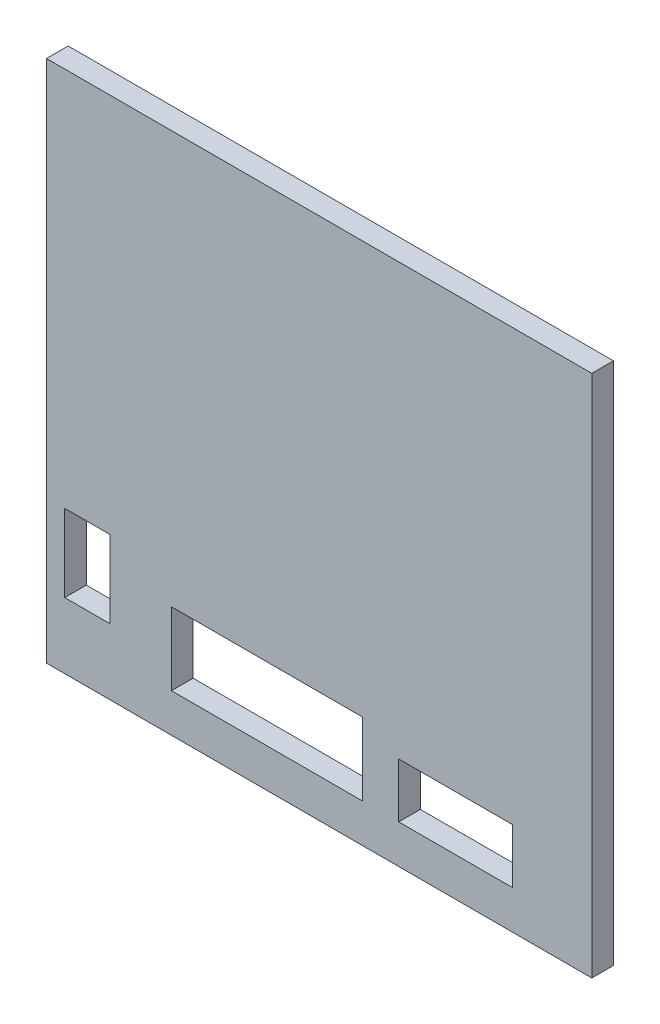
ISO-10303-21;
HEADER;
FILE_DESCRIPTION(('STEP AP214'),'2;1');
FILE_NAME('part.step','',(''),(''),'','','');
FILE_SCHEMA(('AUTOMOTIVE_DESIGN { 1 0 10303 214 1 1 1 1 }'));
ENDSEC;
DATA;
#1=APPLICATION_CONTEXT('core data for automotive mechanical design processes');
#2=APPLICATION_PROTOCOL_DEFINITION('international standard','automotive_design',2000,#1);
#3=PRODUCT_CONTEXT('',#1,'mechanical');
#4=PRODUCT('Part','Part','',(#3));
#5=PRODUCT_RELATED_PRODUCT_CATEGORY('part','',(#4));
#6=PRODUCT_DEFINITION_FORMATION('','',#4);
#7=PRODUCT_DEFINITION_CONTEXT('part definition',#1,'design');
#8=PRODUCT_DEFINITION('design','',#6,#7);
#9=PRODUCT_DEFINITION_SHAPE('','',#8);
#10=(LENGTH_UNIT() NAMED_UNIT(*) SI_UNIT(.MILLI.,.METRE.));
#11=(NAMED_UNIT(*) PLANE_ANGLE_UNIT() SI_UNIT($,.RADIAN.));
#12=(NAMED_UNIT(*) SI_UNIT($,.STERADIAN.) SOLID_ANGLE_UNIT());
#13=UNCERTAINTY_MEASURE_WITH_UNIT(LENGTH_MEASURE(1.E-05),#10,'distance_accuracy_value','');
#14=(GEOMETRIC_REPRESENTATION_CONTEXT(3) GLOBAL_UNCERTAINTY_ASSIGNED_CONTEXT((#13)) GLOBAL_UNIT_ASSIGNED_CONTEXT((#10,
#11,#12)) REPRESENTATION_CONTEXT('',''));
#15=CARTESIAN_POINT('',(0.,0.,0.));
#16=DIRECTION('',(0.,0.,1.));
#17=DIRECTION('',(1.,0.,0.));
#18=AXIS2_PLACEMENT_3D('',#15,#16,#17);
#19=CARTESIAN_POINT('',(60.,-57.61875,-4.7625));
#20=DIRECTION('',(1.,0.,0.));
#21=DIRECTION('',(0.,0.,-1.));
#22=AXIS2_PLACEMENT_3D('',#19,#20,#21);
#23=PLANE('',#22);
#24=DIRECTION('',(0.,1.,0.));
#25=VECTOR('',#24,1.);
#26=CARTESIAN_POINT('',(60.,-57.61875,0.));
#27=LINE('',#26,#25);
#28=CARTESIAN_POINT('',(60.,-57.61875,0.));
#29=VERTEX_POINT('',#28);
#30=CARTESIAN_POINT('',(60.,57.61875,0.));
#31=VERTEX_POINT('',#30);
#32=EDGE_CURVE('E239',#29,#31,#27,.T.);
#33=ORIENTED_EDGE('',*,*,#32,.F.);
#34=DIRECTION('',(0.,0.,1.));
#35=VECTOR('',#34,1.);
#36=CARTESIAN_POINT('',(60.,-57.61875,-4.7625));
#37=LINE('',#36,#35);
#38=CARTESIAN_POINT('',(60.,-57.61875,-4.7625));
#39=VERTEX_POINT('',#38);
#40=EDGE_CURVE('E11',#39,#29,#37,.T.);
#41=ORIENTED_EDGE('',*,*,#40,.F.);
#42=DIRECTION('',(0.,1.,0.));
#43=VECTOR('',#42,1.);
#44=CARTESIAN_POINT('',(60.,-57.61875,-4.7625));
#45=LINE('',#44,#43);
#46=CARTESIAN_POINT('',(60.,57.61875,-4.7625));
#47=VERTEX_POINT('',#46);
#48=EDGE_CURVE('E246',#39,#47,#45,.T.);
#49=ORIENTED_EDGE('',*,*,#48,.T.);
#50=DIRECTION('',(0.,0.,1.));
#51=VECTOR('',#50,1.);
#52=CARTESIAN_POINT('',(60.,57.61875,-4.7625));
#53=LINE('',#52,#51);
#54=EDGE_CURVE('E35',#47,#31,#53,.T.);
#55=ORIENTED_EDGE('',*,*,#54,.T.);
#56=EDGE_LOOP('',(#33,#41,#49,#55));
#57=FACE_BOUND('',#56,.T.);
#58=ADVANCED_FACE('F32',(#57),#23,.T.);
#59=CARTESIAN_POINT('',(-60.,-57.61875,-4.7625));
#60=DIRECTION('',(0.,-1.,0.));
#61=DIRECTION('',(0.,0.,-1.));
#62=AXIS2_PLACEMENT_3D('',#59,#60,#61);
#63=PLANE('',#62);
#64=DIRECTION('',(1.,0.,0.));
#65=VECTOR('',#64,1.);
#66=CARTESIAN_POINT('',(-60.,-57.61875,0.));
#67=LINE('',#66,#65);
#68=CARTESIAN_POINT('',(-60.,-57.61875,0.));
#69=VERTEX_POINT('',#68);
#70=EDGE_CURVE('E250',#69,#29,#67,.T.);
#71=ORIENTED_EDGE('',*,*,#70,.F.);
#72=DIRECTION('',(0.,0.,1.));
#73=VECTOR('',#72,1.);
#74=CARTESIAN_POINT('',(-60.,-57.61875,-4.7625));
#75=LINE('',#74,#73);
#76=CARTESIAN_POINT('',(-60.,-57.61875,-4.7625));
#77=VERTEX_POINT('',#76);
#78=EDGE_CURVE('E40',#77,#69,#75,.T.);
#79=ORIENTED_EDGE('',*,*,#78,.F.);
#80=DIRECTION('',(1.,0.,0.));
#81=VECTOR('',#80,1.);
#82=CARTESIAN_POINT('',(-60.,-57.61875,-4.7625));
#83=LINE('',#82,#81);
#84=EDGE_CURVE('E256',#77,#39,#83,.T.);
#85=ORIENTED_EDGE('',*,*,#84,.T.);
#86=ORIENTED_EDGE('',*,*,#40,.T.);
#87=EDGE_LOOP('',(#71,#79,#85,#86));
#88=FACE_BOUND('',#87,.T.);
#89=ADVANCED_FACE('F282',(#88),#63,.T.);
#90=CARTESIAN_POINT('',(-60.,-57.61875,-4.7625));
#91=DIRECTION('',(-1.,0.,0.));
#92=DIRECTION('',(0.,0.,1.));
#93=AXIS2_PLACEMENT_3D('',#90,#91,#92);
#94=PLANE('',#93);
#95=DIRECTION('',(0.,-1.,0.));
#96=VECTOR('',#95,1.);
#97=CARTESIAN_POINT('',(-60.,-57.61875,0.));
#98=LINE('',#97,#96);
#99=CARTESIAN_POINT('',(-60.,57.61875,0.));
#100=VERTEX_POINT('',#99);
#101=EDGE_CURVE('E264',#100,#69,#98,.T.);
#102=ORIENTED_EDGE('',*,*,#101,.F.);
#103=DIRECTION('',(0.,0.,1.));
#104=VECTOR('',#103,1.);
#105=CARTESIAN_POINT('',(-60.,57.61875,-4.7625));
#106=LINE('',#105,#104);
#107=CARTESIAN_POINT('',(-60.,57.61875,-4.7625));
#108=VERTEX_POINT('',#107);
#109=EDGE_CURVE('E269',#108,#100,#106,.T.);
#110=ORIENTED_EDGE('',*,*,#109,.F.);
#111=DIRECTION('',(0.,-1.,0.));
#112=VECTOR('',#111,1.);
#113=CARTESIAN_POINT('',(-60.,-57.61875,-4.7625));
#114=LINE('',#113,#112);
#115=EDGE_CURVE('E253',#108,#77,#114,.T.);
#116=ORIENTED_EDGE('',*,*,#115,.T.);
#117=ORIENTED_EDGE('',*,*,#78,.T.);
#118=EDGE_LOOP('',(#102,#110,#116,#117));
#119=FACE_BOUND('',#118,.T.);
#120=ADVANCED_FACE('F287',(#119),#94,.T.);
#121=CARTESIAN_POINT('',(-60.,57.61875,-4.7625));
#122=DIRECTION('',(0.,1.,0.));
#123=DIRECTION('',(0.,0.,1.));
#124=AXIS2_PLACEMENT_3D('',#121,#122,#123);
#125=PLANE('',#124);
#126=DIRECTION('',(-1.,0.,0.));
#127=VECTOR('',#126,1.);
#128=CARTESIAN_POINT('',(-60.,57.61875,0.));
#129=LINE('',#128,#127);
#130=EDGE_CURVE('E261',#31,#100,#129,.T.);
#131=ORIENTED_EDGE('',*,*,#130,.F.);
#132=ORIENTED_EDGE('',*,*,#54,.F.);
#133=DIRECTION('',(-1.,0.,0.));
#134=VECTOR('',#133,1.);
#135=CARTESIAN_POINT('',(-60.,57.61875,-4.7625));
#136=LINE('',#135,#134);
#137=EDGE_CURVE('E249',#47,#108,#136,.T.);
#138=ORIENTED_EDGE('',*,*,#137,.T.);
#139=ORIENTED_EDGE('',*,*,#109,.T.);
#140=EDGE_LOOP('',(#131,#132,#138,#139));
#141=FACE_BOUND('',#140,.T.);
#142=ADVANCED_FACE('F277',(#141),#125,.T.);
#143=CARTESIAN_POINT('',(0.,0.,-4.7625));
#144=DIRECTION('',(0.,0.,-1.));
#145=DIRECTION('',(-1.,0.,0.));
#146=AXIS2_PLACEMENT_3D('',#143,#144,#145);
#147=PLANE('',#146);
#148=DIRECTION('',(0.,1.,0.));
#149=VECTOR('',#148,1.);
#150=CARTESIAN_POINT('',(-46.,-26.11875,-4.7625));
#151=LINE('',#150,#149);
#152=CARTESIAN_POINT('',(-46.,-43.11875,-4.7625));
#153=VERTEX_POINT('',#152);
#154=CARTESIAN_POINT('',(-46.,-26.11875,-4.7625));
#155=VERTEX_POINT('',#154);
#156=EDGE_CURVE('E147',#153,#155,#151,.T.);
#157=ORIENTED_EDGE('',*,*,#156,.T.);
#158=DIRECTION('',(-1.,0.,0.));
#159=VECTOR('',#158,1.);
#160=CARTESIAN_POINT('',(-56.,-26.11875,-4.7625));
#161=LINE('',#160,#159);
#162=CARTESIAN_POINT('',(-56.,-26.11875,-4.7625));
#163=VERTEX_POINT('',#162);
#164=EDGE_CURVE('E156',#155,#163,#161,.T.);
#165=ORIENTED_EDGE('',*,*,#164,.T.);
#166=DIRECTION('',(0.,-1.,0.));
#167=VECTOR('',#166,1.);
#168=CARTESIAN_POINT('',(-56.,-26.11875,-4.7625));
#169=LINE('',#168,#167);
#170=CARTESIAN_POINT('',(-56.,-43.11875,-4.7625));
#171=VERTEX_POINT('',#170);
#172=EDGE_CURVE('E48',#163,#171,#169,.T.);
#173=ORIENTED_EDGE('',*,*,#172,.T.);
#174=DIRECTION('',(1.,0.,0.));
#175=VECTOR('',#174,1.);
#176=CARTESIAN_POINT('',(-56.,-43.11875,-4.7625));
#177=LINE('',#176,#175);
#178=EDGE_CURVE('E153',#171,#153,#177,.T.);
#179=ORIENTED_EDGE('',*,*,#178,.T.);
#180=EDGE_LOOP('',(#157,#165,#173,#179));
#181=FACE_BOUND('',#180,.T.);
#182=DIRECTION('',(0.,1.,0.));
#183=VECTOR('',#182,1.);
#184=CARTESIAN_POINT('',(9.5,-33.11875,-4.7625));
#185=LINE('',#184,#183);
#186=CARTESIAN_POINT('',(9.5,-49.11875,-4.7625));
#187=VERTEX_POINT('',#186);
#188=CARTESIAN_POINT('',(9.5,-33.11875,-4.7625));
#189=VERTEX_POINT('',#188);
#190=EDGE_CURVE('E182',#187,#189,#185,.T.);
#191=ORIENTED_EDGE('',*,*,#190,.T.);
#192=DIRECTION('',(-1.,0.,0.));
#193=VECTOR('',#192,1.);
#194=CARTESIAN_POINT('',(-32.5,-33.11875,-4.7625));
#195=LINE('',#194,#193);
#196=CARTESIAN_POINT('',(-32.5,-33.11875,-4.7625));
#197=VERTEX_POINT('',#196);
#198=EDGE_CURVE('E185',#189,#197,#195,.T.);
#199=ORIENTED_EDGE('',*,*,#198,.T.);
#200=DIRECTION('',(0.,-1.,0.));
#201=VECTOR('',#200,1.);
#202=CARTESIAN_POINT('',(-32.5,-33.11875,-4.7625));
#203=LINE('',#202,#201);
#204=CARTESIAN_POINT('',(-32.5,-49.11875,-4.7625));
#205=VERTEX_POINT('',#204);
#206=EDGE_CURVE('E189',#197,#205,#203,.T.);
#207=ORIENTED_EDGE('',*,*,#206,.T.);
#208=DIRECTION('',(1.,0.,0.));
#209=VECTOR('',#208,1.);
#210=CARTESIAN_POINT('',(-32.5,-49.11875,-4.7625));
#211=LINE('',#210,#209);
#212=EDGE_CURVE('E192',#205,#187,#211,.T.);
#213=ORIENTED_EDGE('',*,*,#212,.T.);
#214=EDGE_LOOP('',(#191,#199,#207,#213));
#215=FACE_BOUND('',#214,.T.);
#216=DIRECTION('',(0.,1.,0.));
#217=VECTOR('',#216,1.);
#218=CARTESIAN_POINT('',(42.5,-37.11875,-4.7625));
#219=LINE('',#218,#217);
#220=CARTESIAN_POINT('',(42.5,-49.11875,-4.7625));
#221=VERTEX_POINT('',#220);
#222=CARTESIAN_POINT('',(42.5,-37.11875,-4.7625));
#223=VERTEX_POINT('',#222);
#224=EDGE_CURVE('E214',#221,#223,#219,.T.);
#225=ORIENTED_EDGE('',*,*,#224,.T.);
#226=DIRECTION('',(-1.,0.,0.));
#227=VECTOR('',#226,1.);
#228=CARTESIAN_POINT('',(17.5,-37.11875,-4.7625));
#229=LINE('',#228,#227);
#230=CARTESIAN_POINT('',(17.5,-37.11875,-4.7625));
#231=VERTEX_POINT('',#230);
#232=EDGE_CURVE('E217',#223,#231,#229,.T.);
#233=ORIENTED_EDGE('',*,*,#232,.T.);
#234=DIRECTION('',(0.,-1.,0.));
#235=VECTOR('',#234,1.);
#236=CARTESIAN_POINT('',(17.5,-37.11875,-4.7625));
#237=LINE('',#236,#235);
#238=CARTESIAN_POINT('',(17.5,-49.11875,-4.7625));
#239=VERTEX_POINT('',#238);
#240=EDGE_CURVE('E221',#231,#239,#237,.T.);
#241=ORIENTED_EDGE('',*,*,#240,.T.);
#242=DIRECTION('',(1.,0.,0.));
#243=VECTOR('',#242,1.);
#244=CARTESIAN_POINT('',(17.5,-49.11875,-4.7625));
#245=LINE('',#244,#243);
#246=EDGE_CURVE('E224',#239,#221,#245,.T.);
#247=ORIENTED_EDGE('',*,*,#246,.T.);
#248=EDGE_LOOP('',(#225,#233,#241,#247));
#249=FACE_BOUND('',#248,.T.);
#250=ORIENTED_EDGE('',*,*,#48,.F.);
#251=ORIENTED_EDGE('',*,*,#84,.F.);
#252=ORIENTED_EDGE('',*,*,#115,.F.);
#253=ORIENTED_EDGE('',*,*,#137,.F.);
#254=EDGE_LOOP('',(#250,#251,#252,#253));
#255=FACE_BOUND('',#254,.T.);
#256=ADVANCED_FACE('F160',(#181,#215,#249,#255),#147,.T.);
#257=CARTESIAN_POINT('',(0.,0.,0.));
#258=DIRECTION('',(0.,0.,-1.));
#259=DIRECTION('',(-1.,0.,0.));
#260=AXIS2_PLACEMENT_3D('',#257,#258,#259);
#261=PLANE('',#260);
#262=DIRECTION('',(-1.,0.,0.));
#263=VECTOR('',#262,1.);
#264=CARTESIAN_POINT('',(-56.,-26.11875,0.));
#265=LINE('',#264,#263);
#266=CARTESIAN_POINT('',(-46.,-26.11875,0.));
#267=VERTEX_POINT('',#266);
#268=CARTESIAN_POINT('',(-56.,-26.11875,0.));
#269=VERTEX_POINT('',#268);
#270=EDGE_CURVE('E172',#267,#269,#265,.T.);
#271=ORIENTED_EDGE('',*,*,#270,.F.);
#272=DIRECTION('',(0.,1.,0.));
#273=VECTOR('',#272,1.);
#274=CARTESIAN_POINT('',(-46.,-26.11875,0.));
#275=LINE('',#274,#273);
#276=CARTESIAN_POINT('',(-46.,-43.11875,0.));
#277=VERTEX_POINT('',#276);
#278=EDGE_CURVE('E56',#277,#267,#275,.T.);
#279=ORIENTED_EDGE('',*,*,#278,.F.);
#280=DIRECTION('',(1.,0.,0.));
#281=VECTOR('',#280,1.);
#282=CARTESIAN_POINT('',(-56.,-43.11875,0.));
#283=LINE('',#282,#281);
#284=CARTESIAN_POINT('',(-56.,-43.11875,0.));
#285=VERTEX_POINT('',#284);
#286=EDGE_CURVE('E163',#285,#277,#283,.T.);
#287=ORIENTED_EDGE('',*,*,#286,.F.);
#288=DIRECTION('',(0.,-1.,0.));
#289=VECTOR('',#288,1.);
#290=CARTESIAN_POINT('',(-56.,-26.11875,0.));
#291=LINE('',#290,#289);
#292=EDGE_CURVE('E166',#269,#285,#291,.T.);
#293=ORIENTED_EDGE('',*,*,#292,.F.);
#294=EDGE_LOOP('',(#271,#279,#287,#293));
#295=FACE_BOUND('',#294,.T.);
#296=DIRECTION('',(-1.,0.,0.));
#297=VECTOR('',#296,1.);
#298=CARTESIAN_POINT('',(-32.5,-33.11875,0.));
#299=LINE('',#298,#297);
#300=CARTESIAN_POINT('',(9.5,-33.11875,0.));
#301=VERTEX_POINT('',#300);
#302=CARTESIAN_POINT('',(-32.5,-33.11875,0.));
#303=VERTEX_POINT('',#302);
#304=EDGE_CURVE('E197',#301,#303,#299,.T.);
#305=ORIENTED_EDGE('',*,*,#304,.F.);
#306=DIRECTION('',(0.,1.,0.));
#307=VECTOR('',#306,1.);
#308=CARTESIAN_POINT('',(9.5,-33.11875,0.));
#309=LINE('',#308,#307);
#310=CARTESIAN_POINT('',(9.5,-49.11875,0.));
#311=VERTEX_POINT('',#310);
#312=EDGE_CURVE('E178',#311,#301,#309,.T.);
#313=ORIENTED_EDGE('',*,*,#312,.F.);
#314=DIRECTION('',(1.,0.,0.));
#315=VECTOR('',#314,1.);
#316=CARTESIAN_POINT('',(-32.5,-49.11875,0.));
#317=LINE('',#316,#315);
#318=CARTESIAN_POINT('',(-32.5,-49.11875,0.));
#319=VERTEX_POINT('',#318);
#320=EDGE_CURVE('E186',#319,#311,#317,.T.);
#321=ORIENTED_EDGE('',*,*,#320,.F.);
#322=DIRECTION('',(0.,-1.,0.));
#323=VECTOR('',#322,1.);
#324=CARTESIAN_POINT('',(-32.5,-33.11875,0.));
#325=LINE('',#324,#323);
#326=EDGE_CURVE('E200',#303,#319,#325,.T.);
#327=ORIENTED_EDGE('',*,*,#326,.F.);
#328=EDGE_LOOP('',(#305,#313,#321,#327));
#329=FACE_BOUND('',#328,.T.);
#330=DIRECTION('',(-1.,0.,0.));
#331=VECTOR('',#330,1.);
#332=CARTESIAN_POINT('',(17.5,-37.11875,0.));
#333=LINE('',#332,#331);
#334=CARTESIAN_POINT('',(42.5,-37.11875,0.));
#335=VERTEX_POINT('',#334);
#336=CARTESIAN_POINT('',(17.5,-37.11875,0.));
#337=VERTEX_POINT('',#336);
#338=EDGE_CURVE('E229',#335,#337,#333,.T.);
#339=ORIENTED_EDGE('',*,*,#338,.F.);
#340=DIRECTION('',(0.,1.,0.));
#341=VECTOR('',#340,1.);
#342=CARTESIAN_POINT('',(42.5,-37.11875,0.));
#343=LINE('',#342,#341);
#344=CARTESIAN_POINT('',(42.5,-49.11875,0.));
#345=VERTEX_POINT('',#344);
#346=EDGE_CURVE('E207',#345,#335,#343,.T.);
#347=ORIENTED_EDGE('',*,*,#346,.F.);
#348=DIRECTION('',(1.,0.,0.));
#349=VECTOR('',#348,1.);
#350=CARTESIAN_POINT('',(17.5,-49.11875,0.));
#351=LINE('',#350,#349);
#352=CARTESIAN_POINT('',(17.5,-49.11875,0.));
#353=VERTEX_POINT('',#352);
#354=EDGE_CURVE('E218',#353,#345,#351,.T.);
#355=ORIENTED_EDGE('',*,*,#354,.F.);
#356=DIRECTION('',(0.,-1.,0.));
#357=VECTOR('',#356,1.);
#358=CARTESIAN_POINT('',(17.5,-37.11875,0.));
#359=LINE('',#358,#357);
#360=EDGE_CURVE('E232',#337,#353,#359,.T.);
#361=ORIENTED_EDGE('',*,*,#360,.F.);
#362=EDGE_LOOP('',(#339,#347,#355,#361));
#363=FACE_BOUND('',#362,.T.);
#364=ORIENTED_EDGE('',*,*,#32,.T.);
#365=ORIENTED_EDGE('',*,*,#130,.T.);
#366=ORIENTED_EDGE('',*,*,#101,.T.);
#367=ORIENTED_EDGE('',*,*,#70,.T.);
#368=EDGE_LOOP('',(#364,#365,#366,#367));
#369=FACE_BOUND('',#368,.T.);
#370=ADVANCED_FACE('F279',(#295,#329,#363,#369),#261,.F.);
#371=CARTESIAN_POINT('',(42.5,-37.11875,-4.7625));
#372=DIRECTION('',(1.,0.,0.));
#373=DIRECTION('',(0.,0.,-1.));
#374=AXIS2_PLACEMENT_3D('',#371,#372,#373);
#375=PLANE('',#374);
#376=ORIENTED_EDGE('',*,*,#346,.T.);
#377=DIRECTION('',(0.,0.,1.));
#378=VECTOR('',#377,1.);
#379=CARTESIAN_POINT('',(42.5,-37.11875,-4.7625));
#380=LINE('',#379,#378);
#381=EDGE_CURVE('E227',#223,#335,#380,.T.);
#382=ORIENTED_EDGE('',*,*,#381,.F.);
#383=ORIENTED_EDGE('',*,*,#224,.F.);
#384=DIRECTION('',(0.,0.,1.));
#385=VECTOR('',#384,1.);
#386=CARTESIAN_POINT('',(42.5,-49.11875,-4.7625));
#387=LINE('',#386,#385);
#388=EDGE_CURVE('E237',#221,#345,#387,.T.);
#389=ORIENTED_EDGE('',*,*,#388,.T.);
#390=EDGE_LOOP('',(#376,#382,#383,#389));
#391=FACE_BOUND('',#390,.T.);
#392=ADVANCED_FACE('F329',(#391),#375,.F.);
#393=CARTESIAN_POINT('',(17.5,-49.11875,-4.7625));
#394=DIRECTION('',(0.,-1.,0.));
#395=DIRECTION('',(0.,0.,-1.));
#396=AXIS2_PLACEMENT_3D('',#393,#394,#395);
#397=PLANE('',#396);
#398=ORIENTED_EDGE('',*,*,#354,.T.);
#399=ORIENTED_EDGE('',*,*,#388,.F.);
#400=ORIENTED_EDGE('',*,*,#246,.F.);
#401=DIRECTION('',(0.,0.,1.));
#402=VECTOR('',#401,1.);
#403=CARTESIAN_POINT('',(17.5,-49.11875,-4.7625));
#404=LINE('',#403,#402);
#405=EDGE_CURVE('E240',#239,#353,#404,.T.);
#406=ORIENTED_EDGE('',*,*,#405,.T.);
#407=EDGE_LOOP('',(#398,#399,#400,#406));
#408=FACE_BOUND('',#407,.T.);
#409=ADVANCED_FACE('F339',(#408),#397,.F.);
#410=CARTESIAN_POINT('',(17.5,-37.11875,-4.7625));
#411=DIRECTION('',(-1.,0.,0.));
#412=DIRECTION('',(0.,0.,1.));
#413=AXIS2_PLACEMENT_3D('',#410,#411,#412);
#414=PLANE('',#413);
#415=ORIENTED_EDGE('',*,*,#360,.T.);
#416=ORIENTED_EDGE('',*,*,#405,.F.);
#417=ORIENTED_EDGE('',*,*,#240,.F.);
#418=DIRECTION('',(0.,0.,1.));
#419=VECTOR('',#418,1.);
#420=CARTESIAN_POINT('',(17.5,-37.11875,-4.7625));
#421=LINE('',#420,#419);
#422=EDGE_CURVE('E242',#231,#337,#421,.T.);
#423=ORIENTED_EDGE('',*,*,#422,.T.);
#424=EDGE_LOOP('',(#415,#416,#417,#423));
#425=FACE_BOUND('',#424,.T.);
#426=ADVANCED_FACE('F349',(#425),#414,.F.);
#427=CARTESIAN_POINT('',(17.5,-37.11875,-4.7625));
#428=DIRECTION('',(0.,1.,0.));
#429=DIRECTION('',(0.,0.,1.));
#430=AXIS2_PLACEMENT_3D('',#427,#428,#429);
#431=PLANE('',#430);
#432=ORIENTED_EDGE('',*,*,#338,.T.);
#433=ORIENTED_EDGE('',*,*,#422,.F.);
#434=ORIENTED_EDGE('',*,*,#232,.F.);
#435=ORIENTED_EDGE('',*,*,#381,.T.);
#436=EDGE_LOOP('',(#432,#433,#434,#435));
#437=FACE_BOUND('',#436,.T.);
#438=ADVANCED_FACE('F359',(#437),#431,.F.);
#439=CARTESIAN_POINT('',(9.5,-33.11875,-4.7625));
#440=DIRECTION('',(1.,0.,0.));
#441=DIRECTION('',(0.,1.,0.));
#442=AXIS2_PLACEMENT_3D('',#439,#440,#441);
#443=PLANE('',#442);
#444=ORIENTED_EDGE('',*,*,#312,.T.);
#445=DIRECTION('',(0.,0.,1.));
#446=VECTOR('',#445,1.);
#447=CARTESIAN_POINT('',(9.5,-33.11875,-4.7625));
#448=LINE('',#447,#446);
#449=EDGE_CURVE('E195',#189,#301,#448,.T.);
#450=ORIENTED_EDGE('',*,*,#449,.F.);
#451=ORIENTED_EDGE('',*,*,#190,.F.);
#452=DIRECTION('',(0.,0.,1.));
#453=VECTOR('',#452,1.);
#454=CARTESIAN_POINT('',(9.5,-49.11875,-4.7625));
#455=LINE('',#454,#453);
#456=EDGE_CURVE('E205',#187,#311,#455,.T.);
#457=ORIENTED_EDGE('',*,*,#456,.T.);
#458=EDGE_LOOP('',(#444,#450,#451,#457));
#459=FACE_BOUND('',#458,.T.);
#460=ADVANCED_FACE('F369',(#459),#443,.F.);
#461=CARTESIAN_POINT('',(-32.5,-49.11875,-4.7625));
#462=DIRECTION('',(0.,-1.,0.));
#463=DIRECTION('',(0.,0.,-1.));
#464=AXIS2_PLACEMENT_3D('',#461,#462,#463);
#465=PLANE('',#464);
#466=ORIENTED_EDGE('',*,*,#320,.T.);
#467=ORIENTED_EDGE('',*,*,#456,.F.);
#468=ORIENTED_EDGE('',*,*,#212,.F.);
#469=DIRECTION('',(0.,0.,1.));
#470=VECTOR('',#469,1.);
#471=CARTESIAN_POINT('',(-32.5,-49.11875,-4.7625));
#472=LINE('',#471,#470);
#473=EDGE_CURVE('E208',#205,#319,#472,.T.);
#474=ORIENTED_EDGE('',*,*,#473,.T.);
#475=EDGE_LOOP('',(#466,#467,#468,#474));
#476=FACE_BOUND('',#475,.T.);
#477=ADVANCED_FACE('F379',(#476),#465,.F.);
#478=CARTESIAN_POINT('',(-32.5,-33.11875,-4.7625));
#479=DIRECTION('',(-1.,0.,0.));
#480=DIRECTION('',(0.,0.,1.));
#481=AXIS2_PLACEMENT_3D('',#478,#479,#480);
#482=PLANE('',#481);
#483=ORIENTED_EDGE('',*,*,#326,.T.);
#484=ORIENTED_EDGE('',*,*,#473,.F.);
#485=ORIENTED_EDGE('',*,*,#206,.F.);
#486=DIRECTION('',(0.,0.,1.));
#487=VECTOR('',#486,1.);
#488=CARTESIAN_POINT('',(-32.5,-33.11875,-4.7625));
#489=LINE('',#488,#487);
#490=EDGE_CURVE('E210',#197,#303,#489,.T.);
#491=ORIENTED_EDGE('',*,*,#490,.T.);
#492=EDGE_LOOP('',(#483,#484,#485,#491));
#493=FACE_BOUND('',#492,.T.);
#494=ADVANCED_FACE('F389',(#493),#482,.F.);
#495=CARTESIAN_POINT('',(-32.5,-33.11875,-4.7625));
#496=DIRECTION('',(0.,1.,0.));
#497=DIRECTION('',(-1.,0.,0.));
#498=AXIS2_PLACEMENT_3D('',#495,#496,#497);
#499=PLANE('',#498);
#500=ORIENTED_EDGE('',*,*,#304,.T.);
#501=ORIENTED_EDGE('',*,*,#490,.F.);
#502=ORIENTED_EDGE('',*,*,#198,.F.);
#503=ORIENTED_EDGE('',*,*,#449,.T.);
#504=EDGE_LOOP('',(#500,#501,#502,#503));
#505=FACE_BOUND('',#504,.T.);
#506=ADVANCED_FACE('F399',(#505),#499,.F.);
#507=CARTESIAN_POINT('',(-46.,-26.11875,-4.7625));
#508=DIRECTION('',(1.,0.,0.));
#509=DIRECTION('',(0.,0.,-1.));
#510=AXIS2_PLACEMENT_3D('',#507,#508,#509);
#511=PLANE('',#510);
#512=ORIENTED_EDGE('',*,*,#278,.T.);
#513=DIRECTION('',(0.,0.,1.));
#514=VECTOR('',#513,1.);
#515=CARTESIAN_POINT('',(-46.,-26.11875,-4.7625));
#516=LINE('',#515,#514);
#517=EDGE_CURVE('E143',#155,#267,#516,.T.);
#518=ORIENTED_EDGE('',*,*,#517,.F.);
#519=ORIENTED_EDGE('',*,*,#156,.F.);
#520=DIRECTION('',(0.,0.,1.));
#521=VECTOR('',#520,1.);
#522=CARTESIAN_POINT('',(-46.,-43.11875,-4.7625));
#523=LINE('',#522,#521);
#524=EDGE_CURVE('E176',#153,#277,#523,.T.);
#525=ORIENTED_EDGE('',*,*,#524,.T.);
#526=EDGE_LOOP('',(#512,#518,#519,#525));
#527=FACE_BOUND('',#526,.T.);
#528=ADVANCED_FACE('F145',(#527),#511,.F.);
#529=CARTESIAN_POINT('',(-56.,-43.11875,-4.7625));
#530=DIRECTION('',(0.,-1.,0.));
#531=DIRECTION('',(0.,0.,-1.));
#532=AXIS2_PLACEMENT_3D('',#529,#530,#531);
#533=PLANE('',#532);
#534=ORIENTED_EDGE('',*,*,#286,.T.);
#535=ORIENTED_EDGE('',*,*,#524,.F.);
#536=ORIENTED_EDGE('',*,*,#178,.F.);
#537=DIRECTION('',(0.,0.,1.));
#538=VECTOR('',#537,1.);
#539=CARTESIAN_POINT('',(-56.,-43.11875,-4.7625));
#540=LINE('',#539,#538);
#541=EDGE_CURVE('E179',#171,#285,#540,.T.);
#542=ORIENTED_EDGE('',*,*,#541,.T.);
#543=EDGE_LOOP('',(#534,#535,#536,#542));
#544=FACE_BOUND('',#543,.T.);
#545=ADVANCED_FACE('F418',(#544),#533,.F.);
#546=CARTESIAN_POINT('',(-56.,-26.11875,-4.7625));
#547=DIRECTION('',(-1.,0.,0.));
#548=DIRECTION('',(0.,-1.,0.));
#549=AXIS2_PLACEMENT_3D('',#546,#547,#548);
#550=PLANE('',#549);
#551=ORIENTED_EDGE('',*,*,#292,.T.);
#552=ORIENTED_EDGE('',*,*,#541,.F.);
#553=ORIENTED_EDGE('',*,*,#172,.F.);
#554=DIRECTION('',(0.,0.,1.));
#555=VECTOR('',#554,1.);
#556=CARTESIAN_POINT('',(-56.,-26.11875,-4.7625));
#557=LINE('',#556,#555);
#558=EDGE_CURVE('E152',#163,#269,#557,.T.);
#559=ORIENTED_EDGE('',*,*,#558,.T.);
#560=EDGE_LOOP('',(#551,#552,#553,#559));
#561=FACE_BOUND('',#560,.T.);
#562=ADVANCED_FACE('F427',(#561),#550,.F.);
#563=CARTESIAN_POINT('',(-56.,-26.11875,-4.7625));
#564=DIRECTION('',(0.,1.,0.));
#565=DIRECTION('',(0.,0.,1.));
#566=AXIS2_PLACEMENT_3D('',#563,#564,#565);
#567=PLANE('',#566);
#568=ORIENTED_EDGE('',*,*,#270,.T.);
#569=ORIENTED_EDGE('',*,*,#558,.F.);
#570=ORIENTED_EDGE('',*,*,#164,.F.);
#571=ORIENTED_EDGE('',*,*,#517,.T.);
#572=EDGE_LOOP('',(#568,#569,#570,#571));
#573=FACE_BOUND('',#572,.T.);
#574=ADVANCED_FACE('F157',(#573),#567,.F.);
#575=CLOSED_SHELL('',(#58,#89,#120,#142,#256,#370,#392,#409,#426,#438,#460,#477,#494,#506,#528,
#545,#562,#574));
#576=MANIFOLD_SOLID_BREP('B2',#575);
#577=ADVANCED_BREP_SHAPE_REPRESENTATION('',(#18,#576),#14);
#578=SHAPE_DEFINITION_REPRESENTATION(#9,#577);
ENDSEC;
END-ISO-10303-21;
